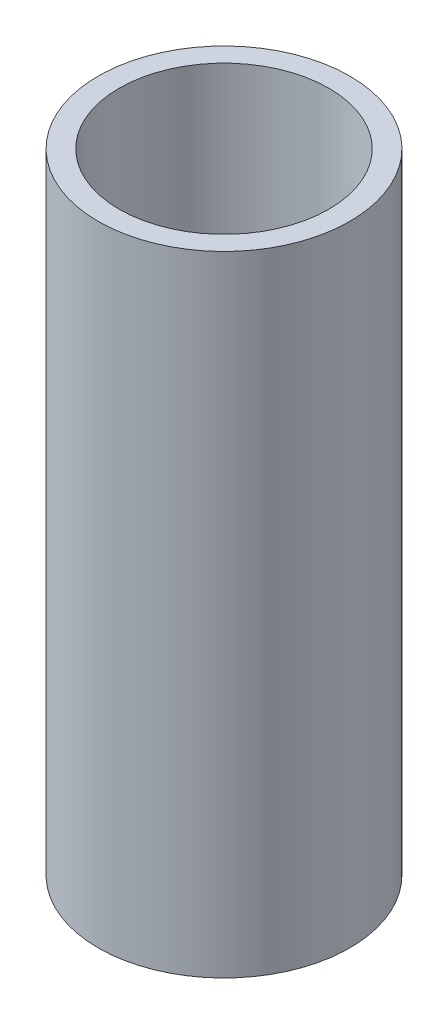
ISO-10303-21;
HEADER;
FILE_DESCRIPTION(('STEP AP214'),'2;1');
FILE_NAME('part.step','',(''),(''),'','','');
FILE_SCHEMA(('AUTOMOTIVE_DESIGN { 1 0 10303 214 1 1 1 1 }'));
ENDSEC;
DATA;
#1=APPLICATION_CONTEXT('core data for automotive mechanical design processes');
#2=APPLICATION_PROTOCOL_DEFINITION('international standard','automotive_design',2000,#1);
#3=PRODUCT_CONTEXT('',#1,'mechanical');
#4=PRODUCT('Part','Part','',(#3));
#5=PRODUCT_RELATED_PRODUCT_CATEGORY('part','',(#4));
#6=PRODUCT_DEFINITION_FORMATION('','',#4);
#7=PRODUCT_DEFINITION_CONTEXT('part definition',#1,'design');
#8=PRODUCT_DEFINITION('design','',#6,#7);
#9=PRODUCT_DEFINITION_SHAPE('','',#8);
#10=(LENGTH_UNIT() NAMED_UNIT(*) SI_UNIT(.MILLI.,.METRE.));
#11=(NAMED_UNIT(*) PLANE_ANGLE_UNIT() SI_UNIT($,.RADIAN.));
#12=(NAMED_UNIT(*) SI_UNIT($,.STERADIAN.) SOLID_ANGLE_UNIT());
#13=UNCERTAINTY_MEASURE_WITH_UNIT(LENGTH_MEASURE(1.E-05),#10,'distance_accuracy_value','');
#14=(GEOMETRIC_REPRESENTATION_CONTEXT(3) GLOBAL_UNCERTAINTY_ASSIGNED_CONTEXT((#13)) GLOBAL_UNIT_ASSIGNED_CONTEXT((#10,
#11,#12)) REPRESENTATION_CONTEXT('',''));
#15=CARTESIAN_POINT('',(0.,0.,0.));
#16=DIRECTION('',(0.,0.,1.));
#17=DIRECTION('',(1.,0.,0.));
#18=AXIS2_PLACEMENT_3D('',#15,#16,#17);
#19=CARTESIAN_POINT('',(0.,15.,0.));
#20=DIRECTION('',(0.,1.,0.));
#21=DIRECTION('',(0.,0.,1.));
#22=AXIS2_PLACEMENT_3D('',#19,#20,#21);
#23=PLANE('',#22);
#24=CARTESIAN_POINT('',(0.,15.,0.));
#25=DIRECTION('',(0.,1.,0.));
#26=DIRECTION('',(0.,0.,1.));
#27=AXIS2_PLACEMENT_3D('',#24,#25,#26);
#28=CIRCLE('',#27,3.);
#29=CARTESIAN_POINT('',(0.,15.,3.));
#30=VERTEX_POINT('',#29);
#31=EDGE_CURVE('E10',#30,#30,#28,.T.);
#32=ORIENTED_EDGE('',*,*,#31,.T.);
#33=EDGE_LOOP('',(#32));
#34=FACE_BOUND('',#33,.T.);
#35=CARTESIAN_POINT('',(0.,15.,0.));
#36=DIRECTION('',(0.,1.,0.));
#37=DIRECTION('',(0.,0.,1.));
#38=AXIS2_PLACEMENT_3D('',#35,#36,#37);
#39=CIRCLE('',#38,2.5);
#40=CARTESIAN_POINT('',(0.,15.,2.5));
#41=VERTEX_POINT('',#40);
#42=EDGE_CURVE('E54',#41,#41,#39,.T.);
#43=ORIENTED_EDGE('',*,*,#42,.F.);
#44=EDGE_LOOP('',(#43));
#45=FACE_BOUND('',#44,.T.);
#46=ADVANCED_FACE('F41',(#34,#45),#23,.T.);
#47=CARTESIAN_POINT('',(0.,0.,0.));
#48=DIRECTION('',(0.,1.,0.));
#49=DIRECTION('',(0.,0.,1.));
#50=AXIS2_PLACEMENT_3D('',#47,#48,#49);
#51=PLANE('',#50);
#52=CARTESIAN_POINT('',(0.,0.,0.));
#53=DIRECTION('',(0.,1.,0.));
#54=DIRECTION('',(0.,0.,1.));
#55=AXIS2_PLACEMENT_3D('',#52,#53,#54);
#56=CIRCLE('',#55,3.);
#57=CARTESIAN_POINT('',(0.,0.,3.));
#58=VERTEX_POINT('',#57);
#59=EDGE_CURVE('E45',#58,#58,#56,.T.);
#60=ORIENTED_EDGE('',*,*,#59,.F.);
#61=EDGE_LOOP('',(#60));
#62=FACE_BOUND('',#61,.T.);
#63=CARTESIAN_POINT('',(0.,0.,0.));
#64=DIRECTION('',(0.,1.,0.));
#65=DIRECTION('',(0.,0.,1.));
#66=AXIS2_PLACEMENT_3D('',#63,#64,#65);
#67=CIRCLE('',#66,2.5);
#68=CARTESIAN_POINT('',(0.,0.,2.5));
#69=VERTEX_POINT('',#68);
#70=EDGE_CURVE('E56',#69,#69,#67,.T.);
#71=ORIENTED_EDGE('',*,*,#70,.T.);
#72=EDGE_LOOP('',(#71));
#73=FACE_BOUND('',#72,.T.);
#74=ADVANCED_FACE('F68',(#62,#73),#51,.F.);
#75=CARTESIAN_POINT('',(0.,15.,0.));
#76=DIRECTION('',(0.,-1.,0.));
#77=DIRECTION('',(0.,0.,-1.));
#78=AXIS2_PLACEMENT_3D('',#75,#76,#77);
#79=CYLINDRICAL_SURFACE('',#78,3.);
#80=ORIENTED_EDGE('',*,*,#31,.F.);
#81=EDGE_LOOP('',(#80));
#82=FACE_BOUND('',#81,.T.);
#83=ORIENTED_EDGE('',*,*,#59,.T.);
#84=EDGE_LOOP('',(#83));
#85=FACE_BOUND('',#84,.T.);
#86=ADVANCED_FACE('F43',(#82,#85),#79,.T.);
#87=CARTESIAN_POINT('',(0.,15.,0.));
#88=DIRECTION('',(0.,-1.,0.));
#89=DIRECTION('',(0.,0.,-1.));
#90=AXIS2_PLACEMENT_3D('',#87,#88,#89);
#91=CYLINDRICAL_SURFACE('',#90,2.5);
#92=ORIENTED_EDGE('',*,*,#42,.T.);
#93=EDGE_LOOP('',(#92));
#94=FACE_BOUND('',#93,.T.);
#95=ORIENTED_EDGE('',*,*,#70,.F.);
#96=EDGE_LOOP('',(#95));
#97=FACE_BOUND('',#96,.T.);
#98=ADVANCED_FACE('F64',(#94,#97),#91,.F.);
#99=CLOSED_SHELL('',(#46,#74,#86,#98));
#100=MANIFOLD_SOLID_BREP('B2',#99);
#101=ADVANCED_BREP_SHAPE_REPRESENTATION('',(#18,#100),#14);
#102=SHAPE_DEFINITION_REPRESENTATION(#9,#101);
ENDSEC;
END-ISO-10303-21;
